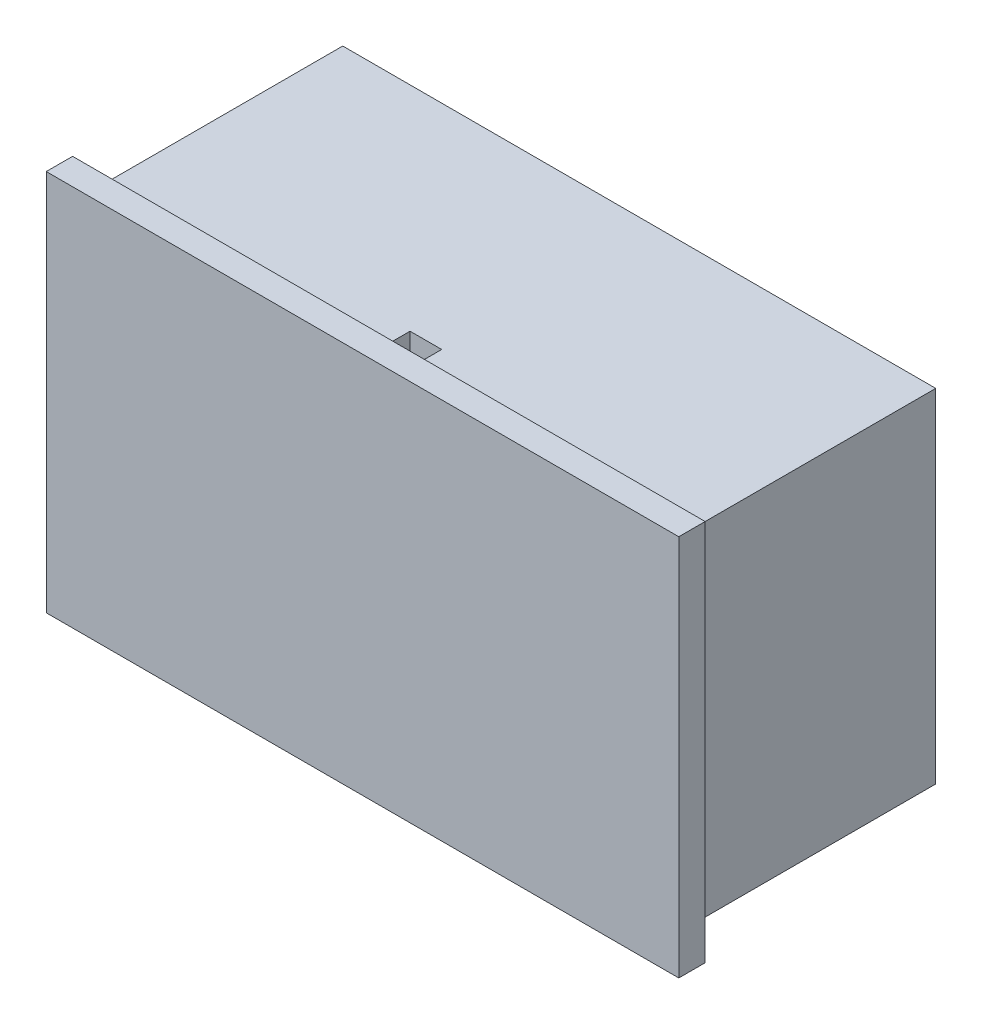
ISO-10303-21;
HEADER;
FILE_DESCRIPTION(('STEP AP214'),'2;1');
FILE_NAME('part.step','',(''),(''),'','','');
FILE_SCHEMA(('AUTOMOTIVE_DESIGN { 1 0 10303 214 1 1 1 1 }'));
ENDSEC;
DATA;
#1=APPLICATION_CONTEXT('core data for automotive mechanical design processes');
#2=APPLICATION_PROTOCOL_DEFINITION('international standard','automotive_design',2000,#1);
#3=PRODUCT_CONTEXT('',#1,'mechanical');
#4=PRODUCT('Part','Part','',(#3));
#5=PRODUCT_RELATED_PRODUCT_CATEGORY('part','',(#4));
#6=PRODUCT_DEFINITION_FORMATION('','',#4);
#7=PRODUCT_DEFINITION_CONTEXT('part definition',#1,'design');
#8=PRODUCT_DEFINITION('design','',#6,#7);
#9=PRODUCT_DEFINITION_SHAPE('','',#8);
#10=(LENGTH_UNIT() NAMED_UNIT(*) SI_UNIT(.MILLI.,.METRE.));
#11=(NAMED_UNIT(*) PLANE_ANGLE_UNIT() SI_UNIT($,.RADIAN.));
#12=(NAMED_UNIT(*) SI_UNIT($,.STERADIAN.) SOLID_ANGLE_UNIT());
#13=UNCERTAINTY_MEASURE_WITH_UNIT(LENGTH_MEASURE(1.E-05),#10,'distance_accuracy_value','');
#14=(GEOMETRIC_REPRESENTATION_CONTEXT(3) GLOBAL_UNCERTAINTY_ASSIGNED_CONTEXT((#13)) GLOBAL_UNIT_ASSIGNED_CONTEXT((#10,
#11,#12)) REPRESENTATION_CONTEXT('',''));
#15=CARTESIAN_POINT('',(0.,0.,0.));
#16=DIRECTION('',(0.,0.,1.));
#17=DIRECTION('',(1.,0.,0.));
#18=AXIS2_PLACEMENT_3D('',#15,#16,#17);
#19=CARTESIAN_POINT('',(-22.5,26.,9.5));
#20=DIRECTION('',(1.,0.,0.));
#21=DIRECTION('',(0.,0.,-1.));
#22=AXIS2_PLACEMENT_3D('',#19,#20,#21);
#23=PLANE('',#22);
#24=DIRECTION('',(0.,0.,1.));
#25=VECTOR('',#24,1.);
#26=CARTESIAN_POINT('',(-22.5,0.,9.5));
#27=LINE('',#26,#25);
#28=CARTESIAN_POINT('',(-22.5,0.,-9.5));
#29=VERTEX_POINT('',#28);
#30=CARTESIAN_POINT('',(-22.5,0.,9.5));
#31=VERTEX_POINT('',#30);
#32=EDGE_CURVE('E234',#29,#31,#27,.T.);
#33=ORIENTED_EDGE('',*,*,#32,.T.);
#34=DIRECTION('',(0.,-1.,0.));
#35=VECTOR('',#34,1.);
#36=CARTESIAN_POINT('',(-22.5,26.,9.5));
#37=LINE('',#36,#35);
#38=CARTESIAN_POINT('',(-22.5,26.,9.5));
#39=VERTEX_POINT('',#38);
#40=EDGE_CURVE('E11',#39,#31,#37,.T.);
#41=ORIENTED_EDGE('',*,*,#40,.F.);
#42=DIRECTION('',(0.,0.,1.));
#43=VECTOR('',#42,1.);
#44=CARTESIAN_POINT('',(-22.5,26.,9.5));
#45=LINE('',#44,#43);
#46=CARTESIAN_POINT('',(-22.5,26.,-9.5));
#47=VERTEX_POINT('',#46);
#48=EDGE_CURVE('E92',#47,#39,#45,.T.);
#49=ORIENTED_EDGE('',*,*,#48,.F.);
#50=DIRECTION('',(0.,-1.,0.));
#51=VECTOR('',#50,1.);
#52=CARTESIAN_POINT('',(-22.5,26.,-9.5));
#53=LINE('',#52,#51);
#54=EDGE_CURVE('E245',#47,#29,#53,.T.);
#55=ORIENTED_EDGE('',*,*,#54,.T.);
#56=EDGE_LOOP('',(#33,#41,#49,#55));
#57=FACE_BOUND('',#56,.T.);
#58=ADVANCED_FACE('F45',(#57),#23,.F.);
#59=CARTESIAN_POINT('',(22.5,26.,9.49999999999999));
#60=DIRECTION('',(-1.,0.,0.));
#61=DIRECTION('',(0.,0.,1.));
#62=AXIS2_PLACEMENT_3D('',#59,#60,#61);
#63=PLANE('',#62);
#64=DIRECTION('',(0.,0.,-1.));
#65=VECTOR('',#64,1.);
#66=CARTESIAN_POINT('',(22.5,0.,9.49999999999999));
#67=LINE('',#66,#65);
#68=CARTESIAN_POINT('',(22.5,0.,9.49999999999999));
#69=VERTEX_POINT('',#68);
#70=CARTESIAN_POINT('',(22.5,0.,-9.50000000000001));
#71=VERTEX_POINT('',#70);
#72=EDGE_CURVE('E252',#69,#71,#67,.T.);
#73=ORIENTED_EDGE('',*,*,#72,.T.);
#74=DIRECTION('',(0.,-1.,0.));
#75=VECTOR('',#74,1.);
#76=CARTESIAN_POINT('',(22.5,26.,-9.50000000000001));
#77=LINE('',#76,#75);
#78=CARTESIAN_POINT('',(22.5,26.,-9.50000000000001));
#79=VERTEX_POINT('',#78);
#80=EDGE_CURVE('E259',#79,#71,#77,.T.);
#81=ORIENTED_EDGE('',*,*,#80,.F.);
#82=DIRECTION('',(0.,0.,-1.));
#83=VECTOR('',#82,1.);
#84=CARTESIAN_POINT('',(22.5,26.,9.49999999999999));
#85=LINE('',#84,#83);
#86=CARTESIAN_POINT('',(22.5,26.,9.49999999999999));
#87=VERTEX_POINT('',#86);
#88=EDGE_CURVE('E240',#87,#79,#85,.T.);
#89=ORIENTED_EDGE('',*,*,#88,.F.);
#90=DIRECTION('',(0.,-1.,0.));
#91=VECTOR('',#90,1.);
#92=CARTESIAN_POINT('',(22.5,26.,9.49999999999999));
#93=LINE('',#92,#91);
#94=EDGE_CURVE('E53',#87,#69,#93,.T.);
#95=ORIENTED_EDGE('',*,*,#94,.T.);
#96=EDGE_LOOP('',(#73,#81,#89,#95));
#97=FACE_BOUND('',#96,.T.);
#98=ADVANCED_FACE('F266',(#97),#63,.F.);
#99=CARTESIAN_POINT('',(22.5,26.,-9.50000000000001));
#100=DIRECTION('',(0.,0.,1.));
#101=DIRECTION('',(1.,0.,0.));
#102=AXIS2_PLACEMENT_3D('',#99,#100,#101);
#103=PLANE('',#102);
#104=DIRECTION('',(-1.,0.,0.));
#105=VECTOR('',#104,1.);
#106=CARTESIAN_POINT('',(22.5,0.,-9.50000000000001));
#107=LINE('',#106,#105);
#108=EDGE_CURVE('E87',#71,#29,#107,.T.);
#109=ORIENTED_EDGE('',*,*,#108,.T.);
#110=ORIENTED_EDGE('',*,*,#54,.F.);
#111=DIRECTION('',(-1.,0.,0.));
#112=VECTOR('',#111,1.);
#113=CARTESIAN_POINT('',(22.5,26.,-9.50000000000001));
#114=LINE('',#113,#112);
#115=EDGE_CURVE('E69',#79,#47,#114,.T.);
#116=ORIENTED_EDGE('',*,*,#115,.F.);
#117=ORIENTED_EDGE('',*,*,#80,.T.);
#118=EDGE_LOOP('',(#109,#110,#116,#117));
#119=FACE_BOUND('',#118,.T.);
#120=ADVANCED_FACE('F276',(#119),#103,.F.);
#121=CARTESIAN_POINT('',(0.,26.,0.));
#122=DIRECTION('',(0.,1.,0.));
#123=DIRECTION('',(0.,0.,1.));
#124=AXIS2_PLACEMENT_3D('',#121,#122,#123);
#125=PLANE('',#124);
#126=DIRECTION('',(0.,0.,1.));
#127=VECTOR('',#126,1.);
#128=CARTESIAN_POINT('',(-1.20320945072526,26.,8.28900797685728));
#129=LINE('',#128,#127);
#130=CARTESIAN_POINT('',(-1.20320945072526,26.,6.68900797685728));
#131=VERTEX_POINT('',#130);
#132=CARTESIAN_POINT('',(-1.20320945072526,26.,8.28900797685728));
#133=VERTEX_POINT('',#132);
#134=EDGE_CURVE('E60',#131,#133,#129,.T.);
#135=ORIENTED_EDGE('',*,*,#134,.F.);
#136=DIRECTION('',(-1.,0.,0.));
#137=VECTOR('',#136,1.);
#138=CARTESIAN_POINT('',(1.19679054927474,26.,6.68900797685728));
#139=LINE('',#138,#137);
#140=CARTESIAN_POINT('',(1.19679054927474,26.,6.68900797685728));
#141=VERTEX_POINT('',#140);
#142=EDGE_CURVE('E165',#141,#131,#139,.T.);
#143=ORIENTED_EDGE('',*,*,#142,.F.);
#144=DIRECTION('',(0.,0.,-1.));
#145=VECTOR('',#144,1.);
#146=CARTESIAN_POINT('',(1.19679054927474,26.,8.28900797685728));
#147=LINE('',#146,#145);
#148=CARTESIAN_POINT('',(1.19679054927474,26.,8.28900797685728));
#149=VERTEX_POINT('',#148);
#150=EDGE_CURVE('E169',#149,#141,#147,.T.);
#151=ORIENTED_EDGE('',*,*,#150,.F.);
#152=DIRECTION('',(1.,0.,0.));
#153=VECTOR('',#152,1.);
#154=CARTESIAN_POINT('',(1.19679054927474,26.,8.28900797685728));
#155=LINE('',#154,#153);
#156=EDGE_CURVE('E178',#133,#149,#155,.T.);
#157=ORIENTED_EDGE('',*,*,#156,.F.);
#158=EDGE_LOOP('',(#135,#143,#151,#157));
#159=FACE_BOUND('',#158,.T.);
#160=ORIENTED_EDGE('',*,*,#48,.T.);
#161=DIRECTION('',(1.,0.,0.));
#162=VECTOR('',#161,1.);
#163=CARTESIAN_POINT('',(22.5,26.,9.49999999999999));
#164=LINE('',#163,#162);
#165=EDGE_CURVE('E237',#39,#87,#164,.T.);
#166=ORIENTED_EDGE('',*,*,#165,.T.);
#167=ORIENTED_EDGE('',*,*,#88,.T.);
#168=ORIENTED_EDGE('',*,*,#115,.T.);
#169=EDGE_LOOP('',(#160,#166,#167,#168));
#170=FACE_BOUND('',#169,.T.);
#171=ADVANCED_FACE('F278',(#159,#170),#125,.T.);
#172=CARTESIAN_POINT('',(0.,0.,0.));
#173=DIRECTION('',(0.,1.,0.));
#174=DIRECTION('',(0.,0.,1.));
#175=AXIS2_PLACEMENT_3D('',#172,#173,#174);
#176=PLANE('',#175);
#177=ORIENTED_EDGE('',*,*,#32,.F.);
#178=ORIENTED_EDGE('',*,*,#108,.F.);
#179=ORIENTED_EDGE('',*,*,#72,.F.);
#180=DIRECTION('',(1.,0.,0.));
#181=VECTOR('',#180,1.);
#182=CARTESIAN_POINT('',(22.5,0.,9.49999999999999));
#183=LINE('',#182,#181);
#184=EDGE_CURVE('E248',#31,#69,#183,.T.);
#185=ORIENTED_EDGE('',*,*,#184,.F.);
#186=EDGE_LOOP('',(#177,#178,#179,#185));
#187=FACE_BOUND('',#186,.T.);
#188=ADVANCED_FACE('F273',(#187),#176,.F.);
#189=CARTESIAN_POINT('',(0.,0.,9.5));
#190=DIRECTION('',(0.,0.,1.));
#191=DIRECTION('',(1.,0.,0.));
#192=AXIS2_PLACEMENT_3D('',#189,#190,#191);
#193=PLANE('',#192);
#194=DIRECTION('',(-1.,0.,0.));
#195=VECTOR('',#194,1.);
#196=CARTESIAN_POINT('',(24.,27.5,9.5));
#197=LINE('',#196,#195);
#198=CARTESIAN_POINT('',(24.,27.5,9.5));
#199=VERTEX_POINT('',#198);
#200=CARTESIAN_POINT('',(-24.,27.5,9.5));
#201=VERTEX_POINT('',#200);
#202=EDGE_CURVE('E187',#199,#201,#197,.T.);
#203=ORIENTED_EDGE('',*,*,#202,.F.);
#204=DIRECTION('',(0.,1.,0.));
#205=VECTOR('',#204,1.);
#206=CARTESIAN_POINT('',(24.,-1.50000000000001,9.5));
#207=LINE('',#206,#205);
#208=CARTESIAN_POINT('',(24.,-1.50000000000001,9.5));
#209=VERTEX_POINT('',#208);
#210=EDGE_CURVE('E198',#209,#199,#207,.T.);
#211=ORIENTED_EDGE('',*,*,#210,.F.);
#212=DIRECTION('',(1.,0.,0.));
#213=VECTOR('',#212,1.);
#214=CARTESIAN_POINT('',(-24.,-1.50000000000001,9.5));
#215=LINE('',#214,#213);
#216=CARTESIAN_POINT('',(-24.,-1.50000000000001,9.5));
#217=VERTEX_POINT('',#216);
#218=EDGE_CURVE('E214',#217,#209,#215,.T.);
#219=ORIENTED_EDGE('',*,*,#218,.F.);
#220=DIRECTION('',(0.,-1.,0.));
#221=VECTOR('',#220,1.);
#222=CARTESIAN_POINT('',(-24.,27.5,9.5));
#223=LINE('',#222,#221);
#224=EDGE_CURVE('E211',#201,#217,#223,.T.);
#225=ORIENTED_EDGE('',*,*,#224,.F.);
#226=EDGE_LOOP('',(#203,#211,#219,#225));
#227=FACE_BOUND('',#226,.T.);
#228=ORIENTED_EDGE('',*,*,#40,.T.);
#229=ORIENTED_EDGE('',*,*,#184,.T.);
#230=ORIENTED_EDGE('',*,*,#94,.F.);
#231=ORIENTED_EDGE('',*,*,#165,.F.);
#232=EDGE_LOOP('',(#228,#229,#230,#231));
#233=FACE_BOUND('',#232,.T.);
#234=ADVANCED_FACE('F274',(#227,#233),#193,.F.);
#235=CARTESIAN_POINT('',(24.,27.5,11.5));
#236=DIRECTION('',(0.,-1.,0.));
#237=DIRECTION('',(1.,0.,0.));
#238=AXIS2_PLACEMENT_3D('',#235,#236,#237);
#239=PLANE('',#238);
#240=ORIENTED_EDGE('',*,*,#202,.T.);
#241=DIRECTION('',(0.,0.,-1.));
#242=VECTOR('',#241,1.);
#243=CARTESIAN_POINT('',(-24.,27.5,11.5));
#244=LINE('',#243,#242);
#245=CARTESIAN_POINT('',(-24.,27.5,11.5));
#246=VERTEX_POINT('',#245);
#247=EDGE_CURVE('E230',#246,#201,#244,.T.);
#248=ORIENTED_EDGE('',*,*,#247,.F.);
#249=DIRECTION('',(-1.,0.,0.));
#250=VECTOR('',#249,1.);
#251=CARTESIAN_POINT('',(24.,27.5,11.5));
#252=LINE('',#251,#250);
#253=CARTESIAN_POINT('',(24.,27.5,11.5));
#254=VERTEX_POINT('',#253);
#255=EDGE_CURVE('E193',#254,#246,#252,.T.);
#256=ORIENTED_EDGE('',*,*,#255,.F.);
#257=DIRECTION('',(0.,0.,-1.));
#258=VECTOR('',#257,1.);
#259=CARTESIAN_POINT('',(24.,27.5,11.5));
#260=LINE('',#259,#258);
#261=EDGE_CURVE('E207',#254,#199,#260,.T.);
#262=ORIENTED_EDGE('',*,*,#261,.T.);
#263=EDGE_LOOP('',(#240,#248,#256,#262));
#264=FACE_BOUND('',#263,.T.);
#265=ADVANCED_FACE('F308',(#264),#239,.F.);
#266=CARTESIAN_POINT('',(-24.,27.5,11.5));
#267=DIRECTION('',(1.,0.,0.));
#268=DIRECTION('',(0.,1.,0.));
#269=AXIS2_PLACEMENT_3D('',#266,#267,#268);
#270=PLANE('',#269);
#271=ORIENTED_EDGE('',*,*,#224,.T.);
#272=DIRECTION('',(0.,0.,-1.));
#273=VECTOR('',#272,1.);
#274=CARTESIAN_POINT('',(-24.,-1.50000000000001,11.5));
#275=LINE('',#274,#273);
#276=CARTESIAN_POINT('',(-24.,-1.50000000000001,11.5));
#277=VERTEX_POINT('',#276);
#278=EDGE_CURVE('E226',#277,#217,#275,.T.);
#279=ORIENTED_EDGE('',*,*,#278,.F.);
#280=DIRECTION('',(0.,-1.,0.));
#281=VECTOR('',#280,1.);
#282=CARTESIAN_POINT('',(-24.,27.5,11.5));
#283=LINE('',#282,#281);
#284=EDGE_CURVE('E197',#246,#277,#283,.T.);
#285=ORIENTED_EDGE('',*,*,#284,.F.);
#286=ORIENTED_EDGE('',*,*,#247,.T.);
#287=EDGE_LOOP('',(#271,#279,#285,#286));
#288=FACE_BOUND('',#287,.T.);
#289=ADVANCED_FACE('F323',(#288),#270,.F.);
#290=CARTESIAN_POINT('',(-24.,-1.50000000000001,11.5));
#291=DIRECTION('',(0.,1.,0.));
#292=DIRECTION('',(0.,0.,1.));
#293=AXIS2_PLACEMENT_3D('',#290,#291,#292);
#294=PLANE('',#293);
#295=ORIENTED_EDGE('',*,*,#218,.T.);
#296=DIRECTION('',(0.,0.,-1.));
#297=VECTOR('',#296,1.);
#298=CARTESIAN_POINT('',(24.,-1.50000000000001,11.5));
#299=LINE('',#298,#297);
#300=CARTESIAN_POINT('',(24.,-1.50000000000001,11.5));
#301=VERTEX_POINT('',#300);
#302=EDGE_CURVE('E222',#301,#209,#299,.T.);
#303=ORIENTED_EDGE('',*,*,#302,.F.);
#304=DIRECTION('',(1.,0.,0.));
#305=VECTOR('',#304,1.);
#306=CARTESIAN_POINT('',(-24.,-1.50000000000001,11.5));
#307=LINE('',#306,#305);
#308=EDGE_CURVE('E201',#277,#301,#307,.T.);
#309=ORIENTED_EDGE('',*,*,#308,.F.);
#310=ORIENTED_EDGE('',*,*,#278,.T.);
#311=EDGE_LOOP('',(#295,#303,#309,#310));
#312=FACE_BOUND('',#311,.T.);
#313=ADVANCED_FACE('F317',(#312),#294,.F.);
#314=CARTESIAN_POINT('',(24.,-1.50000000000001,11.5));
#315=DIRECTION('',(-1.,0.,0.));
#316=DIRECTION('',(0.,0.,1.));
#317=AXIS2_PLACEMENT_3D('',#314,#315,#316);
#318=PLANE('',#317);
#319=ORIENTED_EDGE('',*,*,#210,.T.);
#320=ORIENTED_EDGE('',*,*,#261,.F.);
#321=DIRECTION('',(0.,1.,0.));
#322=VECTOR('',#321,1.);
#323=CARTESIAN_POINT('',(24.,-1.50000000000001,11.5));
#324=LINE('',#323,#322);
#325=EDGE_CURVE('E204',#301,#254,#324,.T.);
#326=ORIENTED_EDGE('',*,*,#325,.F.);
#327=ORIENTED_EDGE('',*,*,#302,.T.);
#328=EDGE_LOOP('',(#319,#320,#326,#327));
#329=FACE_BOUND('',#328,.T.);
#330=ADVANCED_FACE('F322',(#329),#318,.F.);
#331=CARTESIAN_POINT('',(0.,0.,11.5));
#332=DIRECTION('',(0.,0.,1.));
#333=DIRECTION('',(1.,0.,0.));
#334=AXIS2_PLACEMENT_3D('',#331,#332,#333);
#335=PLANE('',#334);
#336=ORIENTED_EDGE('',*,*,#255,.T.);
#337=ORIENTED_EDGE('',*,*,#284,.T.);
#338=ORIENTED_EDGE('',*,*,#308,.T.);
#339=ORIENTED_EDGE('',*,*,#325,.T.);
#340=EDGE_LOOP('',(#336,#337,#338,#339));
#341=FACE_BOUND('',#340,.T.);
#342=ADVANCED_FACE('F349',(#341),#335,.T.);
#343=CARTESIAN_POINT('',(-1.20320945072526,24.,8.28900797685728));
#344=DIRECTION('',(-1.,0.,0.));
#345=DIRECTION('',(0.,0.,1.));
#346=AXIS2_PLACEMENT_3D('',#343,#344,#345);
#347=PLANE('',#346);
#348=ORIENTED_EDGE('',*,*,#134,.T.);
#349=DIRECTION('',(0.,1.,0.));
#350=VECTOR('',#349,1.);
#351=CARTESIAN_POINT('',(-1.20320945072526,24.,8.28900797685728));
#352=LINE('',#351,#350);
#353=CARTESIAN_POINT('',(-1.20320945072526,24.,8.28900797685728));
#354=VERTEX_POINT('',#353);
#355=EDGE_CURVE('E140',#354,#133,#352,.T.);
#356=ORIENTED_EDGE('',*,*,#355,.F.);
#357=DIRECTION('',(0.,0.,1.));
#358=VECTOR('',#357,1.);
#359=CARTESIAN_POINT('',(-1.20320945072526,24.,8.28900797685728));
#360=LINE('',#359,#358);
#361=CARTESIAN_POINT('',(-1.20320945072526,24.,6.68900797685728));
#362=VERTEX_POINT('',#361);
#363=EDGE_CURVE('E144',#362,#354,#360,.T.);
#364=ORIENTED_EDGE('',*,*,#363,.F.);
#365=DIRECTION('',(0.,1.,0.));
#366=VECTOR('',#365,1.);
#367=CARTESIAN_POINT('',(-1.20320945072526,24.,6.68900797685728));
#368=LINE('',#367,#366);
#369=EDGE_CURVE('E184',#362,#131,#368,.T.);
#370=ORIENTED_EDGE('',*,*,#369,.T.);
#371=EDGE_LOOP('',(#348,#356,#364,#370));
#372=FACE_BOUND('',#371,.T.);
#373=ADVANCED_FACE('F142',(#372),#347,.F.);
#374=CARTESIAN_POINT('',(1.19679054927474,24.,6.68900797685728));
#375=DIRECTION('',(0.,0.,-1.));
#376=DIRECTION('',(-1.,0.,0.));
#377=AXIS2_PLACEMENT_3D('',#374,#375,#376);
#378=PLANE('',#377);
#379=ORIENTED_EDGE('',*,*,#142,.T.);
#380=ORIENTED_EDGE('',*,*,#369,.F.);
#381=DIRECTION('',(-1.,0.,0.));
#382=VECTOR('',#381,1.);
#383=CARTESIAN_POINT('',(1.19679054927474,24.,6.68900797685728));
#384=LINE('',#383,#382);
#385=CARTESIAN_POINT('',(1.19679054927474,24.,6.68900797685728));
#386=VERTEX_POINT('',#385);
#387=EDGE_CURVE('E151',#386,#362,#384,.T.);
#388=ORIENTED_EDGE('',*,*,#387,.F.);
#389=DIRECTION('',(0.,1.,0.));
#390=VECTOR('',#389,1.);
#391=CARTESIAN_POINT('',(1.19679054927474,24.,6.68900797685728));
#392=LINE('',#391,#390);
#393=EDGE_CURVE('E188',#386,#141,#392,.T.);
#394=ORIENTED_EDGE('',*,*,#393,.T.);
#395=EDGE_LOOP('',(#379,#380,#388,#394));
#396=FACE_BOUND('',#395,.T.);
#397=ADVANCED_FACE('F368',(#396),#378,.F.);
#398=CARTESIAN_POINT('',(1.19679054927474,24.,8.28900797685728));
#399=DIRECTION('',(1.,0.,0.));
#400=DIRECTION('',(0.,0.,-1.));
#401=AXIS2_PLACEMENT_3D('',#398,#399,#400);
#402=PLANE('',#401);
#403=ORIENTED_EDGE('',*,*,#150,.T.);
#404=ORIENTED_EDGE('',*,*,#393,.F.);
#405=DIRECTION('',(0.,0.,-1.));
#406=VECTOR('',#405,1.);
#407=CARTESIAN_POINT('',(1.19679054927474,24.,8.28900797685728));
#408=LINE('',#407,#406);
#409=CARTESIAN_POINT('',(1.19679054927474,24.,8.28900797685728));
#410=VERTEX_POINT('',#409);
#411=EDGE_CURVE('E160',#410,#386,#408,.T.);
#412=ORIENTED_EDGE('',*,*,#411,.F.);
#413=DIRECTION('',(0.,1.,0.));
#414=VECTOR('',#413,1.);
#415=CARTESIAN_POINT('',(1.19679054927474,24.,8.28900797685728));
#416=LINE('',#415,#414);
#417=EDGE_CURVE('E150',#410,#149,#416,.T.);
#418=ORIENTED_EDGE('',*,*,#417,.T.);
#419=EDGE_LOOP('',(#403,#404,#412,#418));
#420=FACE_BOUND('',#419,.T.);
#421=ADVANCED_FACE('F375',(#420),#402,.F.);
#422=CARTESIAN_POINT('',(1.19679054927474,24.,8.28900797685728));
#423=DIRECTION('',(0.,0.,1.));
#424=DIRECTION('',(1.,0.,0.));
#425=AXIS2_PLACEMENT_3D('',#422,#423,#424);
#426=PLANE('',#425);
#427=ORIENTED_EDGE('',*,*,#156,.T.);
#428=ORIENTED_EDGE('',*,*,#417,.F.);
#429=DIRECTION('',(1.,0.,0.));
#430=VECTOR('',#429,1.);
#431=CARTESIAN_POINT('',(1.19679054927474,24.,8.28900797685728));
#432=LINE('',#431,#430);
#433=EDGE_CURVE('E154',#354,#410,#432,.T.);
#434=ORIENTED_EDGE('',*,*,#433,.F.);
#435=ORIENTED_EDGE('',*,*,#355,.T.);
#436=EDGE_LOOP('',(#427,#428,#434,#435));
#437=FACE_BOUND('',#436,.T.);
#438=ADVANCED_FACE('F155',(#437),#426,.F.);
#439=CARTESIAN_POINT('',(0.,24.,0.));
#440=DIRECTION('',(0.,1.,0.));
#441=DIRECTION('',(0.,0.,1.));
#442=AXIS2_PLACEMENT_3D('',#439,#440,#441);
#443=PLANE('',#442);
#444=ORIENTED_EDGE('',*,*,#363,.T.);
#445=ORIENTED_EDGE('',*,*,#433,.T.);
#446=ORIENTED_EDGE('',*,*,#411,.T.);
#447=ORIENTED_EDGE('',*,*,#387,.T.);
#448=EDGE_LOOP('',(#444,#445,#446,#447));
#449=FACE_BOUND('',#448,.T.);
#450=ADVANCED_FACE('F162',(#449),#443,.T.);
#451=CLOSED_SHELL('',(#58,#98,#120,#171,#188,#234,#265,#289,#313,#330,#342,#373,#397,#421,#438,#450));
#452=MANIFOLD_SOLID_BREP('B2',#451);
#453=ADVANCED_BREP_SHAPE_REPRESENTATION('',(#18,#452),#14);
#454=SHAPE_DEFINITION_REPRESENTATION(#9,#453);
ENDSEC;
END-ISO-10303-21;
